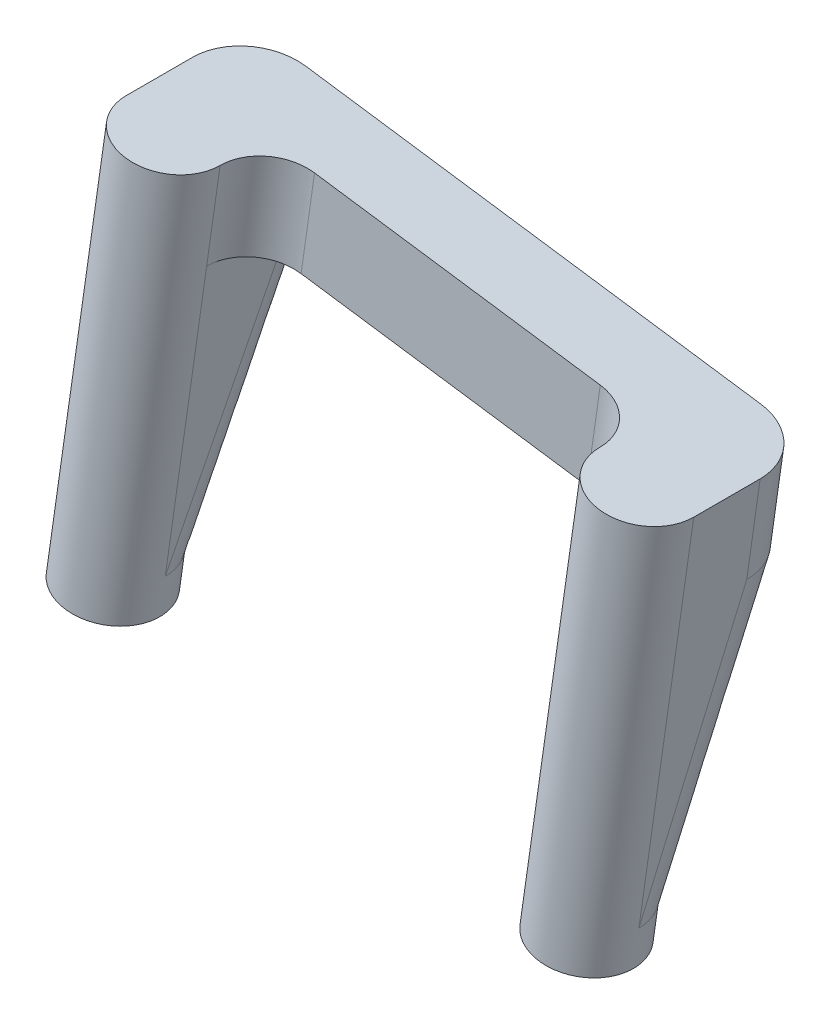
ISO-10303-21;
HEADER;
FILE_DESCRIPTION(('STEP AP214'),'2;1');
FILE_NAME('part.step','',(''),(''),'','','');
FILE_SCHEMA(('AUTOMOTIVE_DESIGN { 1 0 10303 214 1 1 1 1 }'));
ENDSEC;
DATA;
#1=APPLICATION_CONTEXT('core data for automotive mechanical design processes');
#2=APPLICATION_PROTOCOL_DEFINITION('international standard','automotive_design',2000,#1);
#3=PRODUCT_CONTEXT('',#1,'mechanical');
#4=PRODUCT('Part','Part','',(#3));
#5=PRODUCT_RELATED_PRODUCT_CATEGORY('part','',(#4));
#6=PRODUCT_DEFINITION_FORMATION('','',#4);
#7=PRODUCT_DEFINITION_CONTEXT('part definition',#1,'design');
#8=PRODUCT_DEFINITION('design','',#6,#7);
#9=PRODUCT_DEFINITION_SHAPE('','',#8);
#10=(LENGTH_UNIT() NAMED_UNIT(*) SI_UNIT(.MILLI.,.METRE.));
#11=(NAMED_UNIT(*) PLANE_ANGLE_UNIT() SI_UNIT($,.RADIAN.));
#12=(NAMED_UNIT(*) SI_UNIT($,.STERADIAN.) SOLID_ANGLE_UNIT());
#13=UNCERTAINTY_MEASURE_WITH_UNIT(LENGTH_MEASURE(1.E-05),#10,'distance_accuracy_value','');
#14=(GEOMETRIC_REPRESENTATION_CONTEXT(3) GLOBAL_UNCERTAINTY_ASSIGNED_CONTEXT((#13)) GLOBAL_UNIT_ASSIGNED_CONTEXT((#10,
#11,#12)) REPRESENTATION_CONTEXT('',''));
#15=CARTESIAN_POINT('',(0.,0.,0.));
#16=DIRECTION('',(0.,0.,1.));
#17=DIRECTION('',(1.,0.,0.));
#18=AXIS2_PLACEMENT_3D('',#15,#16,#17);
#19=CARTESIAN_POINT('',(98.8270928297793,157.961249583862,53.5258814494827));
#20=DIRECTION('',(0.141668597342475,0.989914141997686,0.));
#21=DIRECTION('',(-0.989914141997686,0.141668597342475,0.));
#22=AXIS2_PLACEMENT_3D('',#19,#20,#21);
#23=CYLINDRICAL_SURFACE('',#22,3.);
#24=CARTESIAN_POINT('',(98.8270928297793,157.961249583862,53.5258814494827));
#25=DIRECTION('',(-0.141668597342475,-0.989914141997686,0.));
#26=DIRECTION('',(0.989914141997687,-0.141668597342475,0.));
#27=AXIS2_PLACEMENT_3D('',#24,#25,#26);
#28=CIRCLE('',#27,2.99999999999999);
#29=CARTESIAN_POINT('',(100.681636853488,157.695842070824,51.1826465258096));
#30=VERTEX_POINT('',#29);
#31=CARTESIAN_POINT('',(101.146701782475,157.629285696521,51.6524360069134));
#32=VERTEX_POINT('',#31);
#33=EDGE_CURVE('E584',#30,#32,#28,.T.);
#34=ORIENTED_EDGE('',*,*,#33,.F.);
#35=CARTESIAN_POINT('',(100.09086644947,157.780388407661,50.8110445762304));
#36=VERTEX_POINT('',#35);
#37=EDGE_CURVE('E585',#36,#30,#28,.T.);
#38=ORIENTED_EDGE('',*,*,#37,.F.);
#39=CARTESIAN_POINT('',(98.8270928297793,157.961249583862,50.5258814494828));
#40=VERTEX_POINT('',#39);
#41=EDGE_CURVE('E573',#40,#36,#28,.T.);
#42=ORIENTED_EDGE('',*,*,#41,.F.);
#43=DIRECTION('',(0.141668597342475,0.989914141997686,0.));
#44=VECTOR('',#43,1.);
#45=CARTESIAN_POINT('',(98.8270928297793,157.961249583862,50.5258814494827));
#46=LINE('',#45,#44);
#47=CARTESIAN_POINT('',(99.5354358164917,162.91082029385,50.5258814494827));
#48=VERTEX_POINT('',#47);
#49=EDGE_CURVE('E355',#40,#48,#46,.T.);
#50=ORIENTED_EDGE('',*,*,#49,.T.);
#51=CARTESIAN_POINT('',(99.5354358164917,162.91082029385,53.5258814494827));
#52=DIRECTION('',(0.141668597342474,0.989914141997687,0.));
#53=DIRECTION('',(-0.989914141997687,0.141668597342474,0.));
#54=AXIS2_PLACEMENT_3D('',#51,#52,#53);
#55=CIRCLE('',#54,3.);
#56=CARTESIAN_POINT('',(102.505178242485,162.485814501823,53.5258814494827));
#57=VERTEX_POINT('',#56);
#58=EDGE_CURVE('E650',#48,#57,#55,.F.);
#59=ORIENTED_EDGE('',*,*,#58,.T.);
#60=DIRECTION('',(0.141668597342475,0.989914141997686,0.));
#61=VECTOR('',#60,1.);
#62=CARTESIAN_POINT('',(101.796835255772,157.536243791834,53.5258814494827));
#63=LINE('',#62,#61);
#64=CARTESIAN_POINT('',(101.796835255772,157.536243791834,53.5258814494827));
#65=VERTEX_POINT('',#64);
#66=EDGE_CURVE('E352',#65,#57,#63,.T.);
#67=ORIENTED_EDGE('',*,*,#66,.F.);
#68=CARTESIAN_POINT('',(101.514540347983,157.576643582005,52.2492353953649));
#69=VERTEX_POINT('',#68);
#70=EDGE_CURVE('E590',#69,#65,#28,.T.);
#71=ORIENTED_EDGE('',*,*,#70,.F.);
#72=EDGE_CURVE('E586',#32,#69,#28,.T.);
#73=ORIENTED_EDGE('',*,*,#72,.F.);
#74=EDGE_LOOP('',(#34,#38,#42,#50,#59,#67,#71,#73));
#75=FACE_BOUND('',#74,.T.);
#76=ADVANCED_FACE('F190',(#75),#23,.T.);
#77=CARTESIAN_POINT('',(74.8711705934353,161.38962963955,53.5258814494827));
#78=DIRECTION('',(0.141668597342475,0.989914141997686,0.));
#79=DIRECTION('',(-0.989914141997686,0.141668597342475,0.));
#80=AXIS2_PLACEMENT_3D('',#77,#78,#79);
#81=CYLINDRICAL_SURFACE('',#80,3.);
#82=CARTESIAN_POINT('',(74.8711705934353,161.38962963955,53.5258814494827));
#83=DIRECTION('',(-0.141668597342475,-0.989914141997686,0.));
#84=DIRECTION('',(0.989914141997687,-0.141668597342475,0.));
#85=AXIS2_PLACEMENT_3D('',#82,#83,#84);
#86=CIRCLE('',#85,3.);
#87=CARTESIAN_POINT('',(73.6074006100787,161.570490295348,50.8110525525518));
#88=VERTEX_POINT('',#87);
#89=CARTESIAN_POINT('',(74.8711705934353,161.38962963955,50.5258814494827));
#90=VERTEX_POINT('',#89);
#91=EDGE_CURVE('E438',#88,#90,#86,.T.);
#92=ORIENTED_EDGE('',*,*,#91,.F.);
#93=CARTESIAN_POINT('',(73.0166805743831,161.655029416934,51.1827148469126));
#94=CARTESIAN_POINT('',(73.0470771436798,161.651057670764,51.1582071911673));
#95=CARTESIAN_POINT('',(73.0779445237038,161.646974675022,51.1343013734666));
#96=CARTESIAN_POINT('',(73.1404708756815,161.638570880599,51.0878005567537));
#97=CARTESIAN_POINT('',(73.1721271218264,161.634250851714,51.0652017532638));
#98=CARTESIAN_POINT('',(73.23621940493,161.625340469877,51.0213047820807));
#99=CARTESIAN_POINT('',(73.2686541665748,161.620750543263,51.0000046659016));
#100=CARTESIAN_POINT('',(73.3343008034066,161.611306688164,50.9587001834623));
#101=CARTESIAN_POINT('',(73.3675126759895,161.606452760564,50.9386958128606));
#102=CARTESIAN_POINT('',(73.4347185953669,161.59650913484,50.899983714717));
#103=CARTESIAN_POINT('',(73.4687137714037,161.591419084018,50.8812780383608));
#104=CARTESIAN_POINT('',(73.5374992531925,161.581064236819,50.8451698254991));
#105=CARTESIAN_POINT('',(73.5722916857937,161.57579895043,50.8277714809408));
#106=CARTESIAN_POINT('',(73.6074091113198,161.570489077769,50.8110708152159));
#107=B_SPLINE_CURVE_WITH_KNOTS('',3,(#93,#94,#95,#96,#97,#98,#99,#100,#101,#102,#103,#104,#105,
#106),.UNSPECIFIED.,.F.,.F.,(4,2,2,2,2,2,4),(0.,0.117734479128843,0.235106949538339,
0.352298751936064,0.469490161651336,0.586862642552341,0.704596699130529),.UNSPECIFIED.);
#108=CARTESIAN_POINT('',(73.0166204555477,161.6550380276,51.1826388850392));
#109=VERTEX_POINT('',#108);
#110=EDGE_CURVE('E439',#109,#88,#107,.T.);
#111=ORIENTED_EDGE('',*,*,#110,.F.);
#112=CARTESIAN_POINT('',(72.5515692044727,161.72159244443,51.652442183354));
#113=VERTEX_POINT('',#112);
#114=EDGE_CURVE('E446',#113,#109,#86,.T.);
#115=ORIENTED_EDGE('',*,*,#114,.F.);
#116=CARTESIAN_POINT('',(72.1837151793978,161.774236771395,52.2492317218964));
#117=VERTEX_POINT('',#116);
#118=EDGE_CURVE('E462',#117,#113,#86,.T.);
#119=ORIENTED_EDGE('',*,*,#118,.F.);
#120=CARTESIAN_POINT('',(71.9014281674423,161.814635431577,53.5258814494827));
#121=VERTEX_POINT('',#120);
#122=EDGE_CURVE('E391',#121,#117,#86,.T.);
#123=ORIENTED_EDGE('',*,*,#122,.F.);
#124=DIRECTION('',(0.141668597342475,0.989914141997686,0.));
#125=VECTOR('',#124,1.);
#126=CARTESIAN_POINT('',(71.9014281674423,161.814635431577,53.5258814494827));
#127=LINE('',#126,#125);
#128=CARTESIAN_POINT('',(72.6097711541547,166.764206141566,53.5258814494827));
#129=VERTEX_POINT('',#128);
#130=EDGE_CURVE('E380',#121,#129,#127,.T.);
#131=ORIENTED_EDGE('',*,*,#130,.T.);
#132=CARTESIAN_POINT('',(75.5795135801477,166.339200349538,53.5258814494827));
#133=DIRECTION('',(0.141668597342474,0.989914141997687,0.));
#134=DIRECTION('',(-0.989914141997687,0.141668597342474,0.));
#135=AXIS2_PLACEMENT_3D('',#132,#133,#134);
#136=CIRCLE('',#135,3.);
#137=CARTESIAN_POINT('',(75.5795135801477,166.339200349538,50.5258814494827));
#138=VERTEX_POINT('',#137);
#139=EDGE_CURVE('E656',#129,#138,#136,.F.);
#140=ORIENTED_EDGE('',*,*,#139,.T.);
#141=DIRECTION('',(0.141668597342475,0.989914141997686,0.));
#142=VECTOR('',#141,1.);
#143=CARTESIAN_POINT('',(74.8711705934353,161.38962963955,50.5258814494827));
#144=LINE('',#143,#142);
#145=EDGE_CURVE('E442',#90,#138,#144,.T.);
#146=ORIENTED_EDGE('',*,*,#145,.F.);
#147=EDGE_LOOP('',(#92,#111,#115,#119,#123,#131,#140,#146));
#148=FACE_BOUND('',#147,.T.);
#149=ADVANCED_FACE('F398',(#148),#81,.T.);
#150=CARTESIAN_POINT('',(24.1359047436339,168.650455244318,-1.13689824128457E-13));
#151=DIRECTION('',(0.141668597342474,0.989914141997687,0.));
#152=DIRECTION('',(-0.989914141997687,0.141668597342474,0.));
#153=AXIS2_PLACEMENT_3D('',#150,#151,#152);
#154=PLANE('',#153);
#155=CARTESIAN_POINT('',(96.8472645457839,158.244586778547,52.5258814494827));
#156=CARTESIAN_POINT('',(96.8472448467732,158.244589597712,52.4695768784455));
#157=CARTESIAN_POINT('',(96.8495429879411,158.244260706122,52.4132637350063));
#158=CARTESIAN_POINT('',(96.8588200791974,158.242933042995,52.3010434435094));
#159=CARTESIAN_POINT('',(96.8657982033263,158.241934389661,52.2451362255706));
#160=CARTESIAN_POINT('',(96.8844750658468,158.239261506425,52.1341621611451));
#161=CARTESIAN_POINT('',(96.896171131682,158.237587658996,52.0790948571727));
#162=CARTESIAN_POINT('',(96.9241900762037,158.233577811676,51.9701754140498));
#163=CARTESIAN_POINT('',(96.94051306131,158.231241796555,51.9163233028796));
#164=CARTESIAN_POINT('',(96.977586248227,158.225936178454,51.810201374565));
#165=CARTESIAN_POINT('',(96.9983364037024,158.222966582106,51.7579315408668));
#166=CARTESIAN_POINT('',(97.0440262958585,158.216427810045,51.6552962187634));
#167=CARTESIAN_POINT('',(97.0689660564899,158.212858630905,51.6049307412469));
#168=CARTESIAN_POINT('',(97.122944127911,158.205133720894,51.5064992674636));
#169=CARTESIAN_POINT('',(97.1519814982116,158.200978124619,51.4584327469172));
#170=CARTESIAN_POINT('',(97.2139643963663,158.192107627807,51.3649656672834));
#171=CARTESIAN_POINT('',(97.2469100457429,158.187392709878,51.3195651911585));
#172=CARTESIAN_POINT('',(97.351662053527,158.172401440048,51.1873813541405));
#173=CARTESIAN_POINT('',(97.4291471059741,158.161312398858,51.1050466041796));
#174=CARTESIAN_POINT('',(97.5966097505536,158.13734648408,50.9549205003877));
#175=CARTESIAN_POINT('',(97.6865913243979,158.124469040661,50.88713379953));
#176=CARTESIAN_POINT('',(97.9701754310067,158.083884750663,50.7093418612083));
#177=CARTESIAN_POINT('',(98.1792776851407,158.053959707886,50.6226032393789));
#178=CARTESIAN_POINT('',(98.4662037991416,158.012897136511,50.5576614046544));
#179=CARTESIAN_POINT('',(98.5378822552514,158.002639088963,50.5456888147095));
#180=CARTESIAN_POINT('',(98.682028915595,157.98200997143,50.5297941934569));
#181=CARTESIAN_POINT('',(98.7544961201877,157.971639044506,50.5258629481201));
#182=CARTESIAN_POINT('',(98.8270928297793,157.961249583862,50.5258814494828));
#183=B_SPLINE_CURVE_WITH_KNOTS('',3,(#155,#156,#157,#158,#159,#160,#161,#162,#163,#164,#165,
#166,#167,#168,#169,#170,#171,#172,#173,#174,#175,#176,#177,#178,#179,#180,#181,#182),
.UNSPECIFIED.,.F.,.F.,(4,2,2,2,2,2,2,2,2,2,2,2,2,4),(0.,0.168877446174552,0.337725095389041,
0.506477232065389,0.675233250384617,0.843987502569643,1.01274271950168,1.181459266309,
1.35018106049599,1.68908461772352,2.02809640711591,2.69760684098695,2.91748695367373,
3.13711497926469),.UNSPECIFIED.);
#184=CARTESIAN_POINT('',(96.8472645457839,158.244586778547,52.5258814494827));
#185=VERTEX_POINT('',#184);
#186=EDGE_CURVE('E463',#185,#40,#183,.T.);
#187=ORIENTED_EDGE('',*,*,#186,.F.);
#188=DIRECTION('',(0.,0.,-1.));
#189=VECTOR('',#188,1.);
#190=CARTESIAN_POINT('',(96.8472645457839,158.244586778547,57.0258814494827));
#191=LINE('',#190,#189);
#192=CARTESIAN_POINT('',(96.8472645457839,158.244586778547,57.0258814494827));
#193=VERTEX_POINT('',#192);
#194=EDGE_CURVE('E524',#193,#185,#191,.T.);
#195=ORIENTED_EDGE('',*,*,#194,.F.);
#196=CARTESIAN_POINT('',(94.3724791907897,158.598758271903,57.0258814494827));
#197=DIRECTION('',(0.141668597342474,0.989914141997687,0.));
#198=DIRECTION('',(-0.989914141997687,0.141668597342474,0.));
#199=AXIS2_PLACEMENT_3D('',#196,#197,#198);
#200=CIRCLE('',#199,2.5);
#201=CARTESIAN_POINT('',(94.3724791907897,158.598758271903,54.5258814494827));
#202=VERTEX_POINT('',#201);
#203=EDGE_CURVE('E648',#193,#202,#200,.T.);
#204=ORIENTED_EDGE('',*,*,#203,.T.);
#205=DIRECTION('',(0.989914141997687,-0.141668597342474,0.));
#206=VECTOR('',#205,1.);
#207=CARTESIAN_POINT('',(24.1359047436339,168.650455244318,54.5258814494827));
#208=LINE('',#207,#206);
#209=CARTESIAN_POINT('',(79.3257842324249,160.752120951509,54.5258814494827));
#210=VERTEX_POINT('',#209);
#211=EDGE_CURVE('E645',#210,#202,#208,.T.);
#212=ORIENTED_EDGE('',*,*,#211,.F.);
#213=CARTESIAN_POINT('',(79.3257842324249,160.752120951509,57.0258814494827));
#214=DIRECTION('',(0.141668597342474,0.989914141997687,0.));
#215=DIRECTION('',(-0.989914141997687,0.141668597342474,0.));
#216=AXIS2_PLACEMENT_3D('',#213,#214,#215);
#217=CIRCLE('',#216,2.50000000000001);
#218=CARTESIAN_POINT('',(76.8509988774307,161.106292444865,57.0258814494828));
#219=VERTEX_POINT('',#218);
#220=EDGE_CURVE('E643',#210,#219,#217,.T.);
#221=ORIENTED_EDGE('',*,*,#220,.T.);
#222=DIRECTION('',(0.,0.,1.));
#223=VECTOR('',#222,1.);
#224=CARTESIAN_POINT('',(76.8509988774307,161.106292444865,57.0258814494828));
#225=LINE('',#224,#223);
#226=CARTESIAN_POINT('',(76.8509988774307,161.106292444865,52.5258814494827));
#227=VERTEX_POINT('',#226);
#228=EDGE_CURVE('E517',#227,#219,#225,.T.);
#229=ORIENTED_EDGE('',*,*,#228,.F.);
#230=CARTESIAN_POINT('',(74.8711705934353,161.38962963955,50.5258814494827));
#231=CARTESIAN_POINT('',(74.9269164241862,161.381651741957,50.5258615356743));
#232=CARTESIAN_POINT('',(74.9826707445061,161.373672629406,50.5281838599682));
#233=CARTESIAN_POINT('',(75.0937772710459,161.357771951657,50.5375585680152));
#234=CARTESIAN_POINT('',(75.1491295465954,161.349850376539,50.544610115685));
#235=CARTESIAN_POINT('',(75.2590018238548,161.334126334679,50.5634834784682));
#236=CARTESIAN_POINT('',(75.3135222783202,161.326323803143,50.575302594946));
#237=CARTESIAN_POINT('',(75.421359693352,161.310890974496,50.603616257291));
#238=CARTESIAN_POINT('',(75.4746766260692,161.303260681371,50.6201109112295));
#239=CARTESIAN_POINT('',(75.5797434407206,161.288224358898,50.6575738260444));
#240=CARTESIAN_POINT('',(75.6314933388251,161.280818327238,50.6785420407401));
#241=CARTESIAN_POINT('',(75.7331070789971,161.266276181177,50.7247120248034));
#242=CARTESIAN_POINT('',(75.7829709104378,161.259140068297,50.7499138180206));
#243=CARTESIAN_POINT('',(75.8804211239414,161.245193772884,50.8044589209834));
#244=CARTESIAN_POINT('',(75.9280080272153,161.238383515759,50.8338012767817));
#245=CARTESIAN_POINT('',(76.0205414985132,161.22514086518,50.8964350218626));
#246=CARTESIAN_POINT('',(76.0654879844044,161.21870848348,50.9297265338904));
#247=CARTESIAN_POINT('',(76.1963338674581,161.199982866849,51.0355660667786));
#248=CARTESIAN_POINT('',(76.2778294246182,161.18831987429,51.1138494385948));
#249=CARTESIAN_POINT('',(76.4264224241892,161.167054432237,51.2830343967947));
#250=CARTESIAN_POINT('',(76.493515259033,161.157452642141,51.3739400058807));
#251=CARTESIAN_POINT('',(76.669482925719,161.1322695566,51.6604330330839));
#252=CARTESIAN_POINT('',(76.7553243046023,161.119984624781,51.8716755901942));
#253=CARTESIAN_POINT('',(76.8195712562523,161.110790114735,52.1614964678972));
#254=CARTESIAN_POINT('',(76.8314111113913,161.10909568933,52.2338698749654));
#255=CARTESIAN_POINT('',(76.8471294551706,161.106846205641,52.3794131090318));
#256=CARTESIAN_POINT('',(76.851017064278,161.106289842109,52.4525819267928));
#257=CARTESIAN_POINT('',(76.8509988774307,161.106292444865,52.5258814494827));
#258=B_SPLINE_CURVE_WITH_KNOTS('',3,(#230,#231,#232,#233,#234,#235,#236,#237,#238,#239,#240,
#241,#242,#243,#244,#245,#246,#247,#248,#249,#250,#251,#252,#253,#254,#255,#256,#257),
.UNSPECIFIED.,.F.,.F.,(4,2,2,2,2,2,2,2,2,2,2,2,2,4),(0.,0.168905124837256,0.337780396669561,
0.50656021214237,0.675343929141257,0.844125903866178,1.01290882944429,1.18165293229897,
1.35040228133102,1.68930488151975,2.02831573881649,2.69782705538182,2.91759715820847,
3.1371150640582),.UNSPECIFIED.);
#259=EDGE_CURVE('E215',#90,#227,#258,.T.);
#260=ORIENTED_EDGE('',*,*,#259,.F.);
#261=DIRECTION('',(0.989914141997687,-0.141668597342474,0.));
#262=VECTOR('',#261,1.);
#263=CARTESIAN_POINT('',(24.1359047436339,168.650455244318,50.5258814494827));
#264=LINE('',#263,#262);
#265=EDGE_CURVE('E383',#90,#40,#264,.T.);
#266=ORIENTED_EDGE('',*,*,#265,.T.);
#267=EDGE_LOOP('',(#187,#195,#204,#212,#221,#229,#260,#266));
#268=FACE_BOUND('',#267,.T.);
#269=ADVANCED_FACE('F408',(#268),#154,.F.);
#270=CARTESIAN_POINT('',(73.0445287074172,152.155271003443,57.0258814494827));
#271=DIRECTION('',(-0.141668597342475,-0.989914141997686,0.));
#272=DIRECTION('',(0.989914141997687,-0.141668597342475,0.));
#273=AXIS2_PLACEMENT_3D('',#270,#271,#272);
#274=CYLINDRICAL_SURFACE('',#273,2.5);
#275=CARTESIAN_POINT('',(71.9111799286774,144.235957867461,57.0258814494827));
#276=DIRECTION('',(0.141668597342475,0.989914141997686,0.));
#277=DIRECTION('',(-0.989914141997686,0.141668597342475,0.));
#278=AXIS2_PLACEMENT_3D('',#275,#276,#277);
#279=CIRCLE('',#278,2.5);
#280=CARTESIAN_POINT('',(69.4363945736832,144.590129360817,57.0258814494827));
#281=VERTEX_POINT('',#280);
#282=EDGE_CURVE('E652',#281,#281,#279,.T.);
#283=ORIENTED_EDGE('',*,*,#282,.T.);
#284=EDGE_LOOP('',(#283));
#285=FACE_BOUND('',#284,.T.);
#286=DIRECTION('',(0.141668597342475,0.989914141997686,0.));
#287=VECTOR('',#286,1.);
#288=CARTESIAN_POINT('',(73.2241964053838,135.763886825981,57.0258814494828));
#289=LINE('',#288,#287);
#290=CARTESIAN_POINT('',(74.6693024783566,145.861614658101,57.0258814494827));
#291=VERTEX_POINT('',#290);
#292=EDGE_CURVE('E617',#291,#219,#289,.T.);
#293=ORIENTED_EDGE('',*,*,#292,.T.);
#294=DIRECTION('',(0.141668597342475,0.989914141997686,0.));
#295=VECTOR('',#294,1.);
#296=CARTESIAN_POINT('',(76.8509988774307,161.106292444865,57.0258814494827));
#297=LINE('',#296,#295);
#298=CARTESIAN_POINT('',(77.5593418641431,166.055863154853,57.0258814494827));
#299=VERTEX_POINT('',#298);
#300=EDGE_CURVE('E371',#219,#299,#297,.T.);
#301=ORIENTED_EDGE('',*,*,#300,.T.);
#302=CARTESIAN_POINT('',(75.0845565091488,166.410034648209,57.0258814494827));
#303=DIRECTION('',(0.141668597342475,0.989914141997686,0.));
#304=DIRECTION('',(-0.989914141997686,0.141668597342475,0.));
#305=AXIS2_PLACEMENT_3D('',#302,#303,#304);
#306=CIRCLE('',#305,2.50000000000001);
#307=CARTESIAN_POINT('',(72.6097711541547,166.764206141566,57.0258814494827));
#308=VERTEX_POINT('',#307);
#309=EDGE_CURVE('E471',#308,#299,#306,.T.);
#310=ORIENTED_EDGE('',*,*,#309,.F.);
#311=DIRECTION('',(0.141668597342475,0.989914141997686,0.));
#312=VECTOR('',#311,1.);
#313=CARTESIAN_POINT('',(71.9014281674423,161.814635431577,57.0258814494827));
#314=LINE('',#313,#312);
#315=CARTESIAN_POINT('',(69.7197317683682,146.569957644813,57.0258814494828));
#316=VERTEX_POINT('',#315);
#317=EDGE_CURVE('E374',#316,#308,#314,.T.);
#318=ORIENTED_EDGE('',*,*,#317,.F.);
#319=CARTESIAN_POINT('',(74.6693024783566,145.861614658101,57.0258814494827));
#320=CARTESIAN_POINT('',(74.6693024783566,145.861614658101,56.7359956326079));
#321=CARTESIAN_POINT('',(74.5691759608211,145.875943964749,56.1078168030919));
#322=CARTESIAN_POINT('',(73.9991415873838,145.957522726679,55.2028703544198));
#323=CARTESIAN_POINT('',(73.1033223000928,146.085725220733,54.6270281179539));
#324=CARTESIAN_POINT('',(72.4814791930513,146.174718434391,54.5258814494828));
#325=CARTESIAN_POINT('',(71.8335819063952,146.267440313924,54.5258814494827));
#326=CARTESIAN_POINT('',(71.179191775646,146.361091397392,54.6796605579632));
#327=CARTESIAN_POINT('',(70.4040326752117,146.472025970216,55.2171544375245));
#328=CARTESIAN_POINT('',(69.8719598825968,146.548171974214,56.0002113386715));
#329=CARTESIAN_POINT('',(69.7197317683682,146.569957644813,56.6612688011183));
#330=CARTESIAN_POINT('',(69.7197317683682,146.569957644813,57.0258814494828));
#331=B_SPLINE_CURVE_WITH_KNOTS('',3,(#319,#320,#321,#322,#323,#324,#325,#326,#327,#328,#329,
#330),.UNSPECIFIED.,.F.,.F.,(4,1,1,1,2,1,1,1,4),(0.,0.110728226371339,0.221456452742678,
0.332184679114017,0.442912905485355,0.582184679114017,0.721456452742678,0.860728226371339,1.),.UNSPECIFIED.);
#332=CARTESIAN_POINT('',(72.1945171233624,146.215786151457,54.5258814494828));
#333=VERTEX_POINT('',#332);
#334=EDGE_CURVE('E613',#316,#333,#331,.F.);
#335=ORIENTED_EDGE('',*,*,#334,.T.);
#336=CARTESIAN_POINT('',(72.1945171233624,146.215786151457,57.0258814494827));
#337=DIRECTION('',(-0.141668597342475,-0.989914141997686,0.));
#338=DIRECTION('',(0.989914141997686,-0.141668597342475,0.));
#339=AXIS2_PLACEMENT_3D('',#336,#337,#338);
#340=CIRCLE('',#339,2.49999999999996);
#341=EDGE_CURVE('E604',#333,#291,#340,.T.);
#342=ORIENTED_EDGE('',*,*,#341,.T.);
#343=EDGE_LOOP('',(#293,#301,#310,#318,#335,#342));
#344=FACE_BOUND('',#343,.T.);
#345=ADVANCED_FACE('F529',(#285,#344),#274,.T.);
#346=CARTESIAN_POINT('',(97.9903650857589,148.585222350412,57.0258814494827));
#347=DIRECTION('',(-0.141668597342475,-0.989914141997686,0.));
#348=DIRECTION('',(0.989914141997687,-0.141668597342475,0.));
#349=AXIS2_PLACEMENT_3D('',#346,#347,#348);
#350=CYLINDRICAL_SURFACE('',#349,2.50000000000001);
#351=CARTESIAN_POINT('',(96.8570163070191,140.665909214431,57.0258814494827));
#352=DIRECTION('',(0.141668597342475,0.989914141997686,0.));
#353=DIRECTION('',(-0.989914141997686,0.141668597342475,0.));
#354=AXIS2_PLACEMENT_3D('',#351,#352,#353);
#355=CIRCLE('',#354,2.50000000000001);
#356=CARTESIAN_POINT('',(94.3822309520249,141.020080707787,57.0258814494827));
#357=VERTEX_POINT('',#356);
#358=EDGE_CURVE('E13',#357,#357,#355,.T.);
#359=ORIENTED_EDGE('',*,*,#358,.T.);
#360=EDGE_LOOP('',(#359));
#361=FACE_BOUND('',#360,.T.);
#362=DIRECTION('',(0.141668597342475,0.989914141997686,0.));
#363=VECTOR('',#362,1.);
#364=CARTESIAN_POINT('',(96.8472645457839,158.244586778547,57.0258814494827));
#365=LINE('',#364,#363);
#366=CARTESIAN_POINT('',(97.5556075324963,163.194157488535,57.0258814494827));
#367=VERTEX_POINT('',#366);
#368=EDGE_CURVE('E364',#193,#367,#365,.T.);
#369=ORIENTED_EDGE('',*,*,#368,.F.);
#370=DIRECTION('',(0.141668597342475,0.989914141997686,0.));
#371=VECTOR('',#370,1.);
#372=CARTESIAN_POINT('',(93.220462073737,132.902181159663,57.0258814494828));
#373=LINE('',#372,#371);
#374=CARTESIAN_POINT('',(94.6655681467098,142.999908991783,57.0258814494827));
#375=VERTEX_POINT('',#374);
#376=EDGE_CURVE('E333',#375,#193,#373,.T.);
#377=ORIENTED_EDGE('',*,*,#376,.F.);
#378=CARTESIAN_POINT('',(99.6151388566983,142.29156600507,57.0258814494827));
#379=CARTESIAN_POINT('',(99.6151388566983,142.29156600507,56.6612688011183));
#380=CARTESIAN_POINT('',(99.4629107424697,142.313351675669,56.0002113386715));
#381=CARTESIAN_POINT('',(98.9308379498548,142.389497679667,55.2171544375246));
#382=CARTESIAN_POINT('',(98.1556788494204,142.500432252492,54.6796605579631));
#383=CARTESIAN_POINT('',(97.5012887186713,142.594083335959,54.5258814494827));
#384=CARTESIAN_POINT('',(96.8533914320151,142.686805215492,54.5258814494827));
#385=CARTESIAN_POINT('',(96.2315483249735,142.77579842915,54.6270281179538));
#386=CARTESIAN_POINT('',(95.3357290376826,142.904000923204,55.2028703544198));
#387=CARTESIAN_POINT('',(94.7656946642453,142.985579685134,56.1078168030919));
#388=CARTESIAN_POINT('',(94.6655681467098,142.999908991783,56.7359956326079));
#389=CARTESIAN_POINT('',(94.6655681467098,142.999908991783,57.0258814494827));
#390=B_SPLINE_CURVE_WITH_KNOTS('',3,(#378,#379,#380,#381,#382,#383,#384,#385,#386,#387,#388,
#389),.UNSPECIFIED.,.F.,.F.,(4,1,1,1,2,1,1,1,4),(0.,0.13927177362866,0.27854354725732,
0.41781532088598,0.55708709451464,0.66781532088598,0.77854354725732,0.88927177362866,1.),.UNSPECIFIED.);
#391=CARTESIAN_POINT('',(97.1403535017041,142.645737498426,54.5258814494827));
#392=VERTEX_POINT('',#391);
#393=EDGE_CURVE('E317',#375,#392,#390,.F.);
#394=ORIENTED_EDGE('',*,*,#393,.T.);
#395=CARTESIAN_POINT('',(97.1403535017041,142.645737498426,57.0258814494827));
#396=DIRECTION('',(-0.141668597342475,-0.989914141997686,0.));
#397=DIRECTION('',(0.989914141997686,-0.141668597342475,0.));
#398=AXIS2_PLACEMENT_3D('',#395,#396,#397);
#399=CIRCLE('',#398,2.5);
#400=CARTESIAN_POINT('',(99.6151388566983,142.29156600507,57.0258814494827));
#401=VERTEX_POINT('',#400);
#402=EDGE_CURVE('E312',#392,#401,#399,.T.);
#403=ORIENTED_EDGE('',*,*,#402,.T.);
#404=DIRECTION('',(0.141668597342475,0.989914141997686,0.));
#405=VECTOR('',#404,1.);
#406=CARTESIAN_POINT('',(101.796835255772,157.536243791834,57.0258814494827));
#407=LINE('',#406,#405);
#408=CARTESIAN_POINT('',(102.505178242485,162.485814501823,57.0258814494827));
#409=VERTEX_POINT('',#408);
#410=EDGE_CURVE('E356',#401,#409,#407,.T.);
#411=ORIENTED_EDGE('',*,*,#410,.T.);
#412=CARTESIAN_POINT('',(100.030392887491,162.839985995179,57.0258814494827));
#413=DIRECTION('',(0.141668597342475,0.989914141997686,0.));
#414=DIRECTION('',(-0.989914141997686,0.141668597342475,0.));
#415=AXIS2_PLACEMENT_3D('',#412,#413,#414);
#416=CIRCLE('',#415,2.50000000000001);
#417=EDGE_CURVE('E377',#367,#409,#416,.T.);
#418=ORIENTED_EDGE('',*,*,#417,.F.);
#419=EDGE_LOOP('',(#369,#377,#394,#403,#411,#418));
#420=FACE_BOUND('',#419,.T.);
#421=ADVANCED_FACE('F192',(#361,#420),#350,.T.);
#422=CARTESIAN_POINT('',(96.8570163070191,140.665909214431,57.0258814494827));
#423=DIRECTION('',(0.141668597342475,0.989914141997686,0.));
#424=DIRECTION('',(-0.989914141997686,0.141668597342475,0.));
#425=AXIS2_PLACEMENT_3D('',#422,#423,#424);
#426=PLANE('',#425);
#427=ORIENTED_EDGE('',*,*,#358,.F.);
#428=EDGE_LOOP('',(#427));
#429=FACE_BOUND('',#428,.T.);
#430=CARTESIAN_POINT('',(96.8570163070191,140.665909214431,57.0258814494827));
#431=DIRECTION('',(0.141668597342475,0.989914141997686,0.));
#432=DIRECTION('',(-0.989914141997686,0.141668597342475,0.));
#433=AXIS2_PLACEMENT_3D('',#430,#431,#432);
#434=CIRCLE('',#433,0.850000000000016);
#435=CARTESIAN_POINT('',(96.015589286321,140.786327522172,57.0258814494827));
#436=VERTEX_POINT('',#435);
#437=EDGE_CURVE('E207',#436,#436,#434,.T.);
#438=ORIENTED_EDGE('',*,*,#437,.T.);
#439=EDGE_LOOP('',(#438));
#440=FACE_BOUND('',#439,.T.);
#441=ADVANCED_FACE('F691',(#429,#440),#426,.F.);
#442=CARTESIAN_POINT('',(97.9903650857589,148.585222350412,57.0258814494827));
#443=DIRECTION('',(-0.141668597342475,-0.989914141997686,0.));
#444=DIRECTION('',(0.989914141997687,-0.141668597342475,0.));
#445=AXIS2_PLACEMENT_3D('',#442,#443,#444);
#446=CYLINDRICAL_SURFACE('',#445,0.850000000000016);
#447=CARTESIAN_POINT('',(97.9903650857589,148.585222350412,57.0258814494827));
#448=DIRECTION('',(0.141668597342475,0.989914141997686,0.));
#449=DIRECTION('',(-0.989914141997686,0.141668597342475,0.));
#450=AXIS2_PLACEMENT_3D('',#447,#448,#449);
#451=CIRCLE('',#450,0.850000000000016);
#452=CARTESIAN_POINT('',(97.1489380650608,148.705640658153,57.0258814494827));
#453=VERTEX_POINT('',#452);
#454=EDGE_CURVE('E680',#453,#453,#451,.T.);
#455=ORIENTED_EDGE('',*,*,#454,.T.);
#456=EDGE_LOOP('',(#455));
#457=FACE_BOUND('',#456,.T.);
#458=ORIENTED_EDGE('',*,*,#437,.F.);
#459=EDGE_LOOP('',(#458));
#460=FACE_BOUND('',#459,.T.);
#461=ADVANCED_FACE('F693',(#457,#460),#446,.F.);
#462=CARTESIAN_POINT('',(97.9903650857589,148.585222350412,57.0258814494827));
#463=DIRECTION('',(0.141668597342475,0.989914141997686,0.));
#464=DIRECTION('',(-0.989914141997686,0.141668597342475,0.));
#465=AXIS2_PLACEMENT_3D('',#462,#463,#464);
#466=PLANE('',#465);
#467=ORIENTED_EDGE('',*,*,#454,.F.);
#468=EDGE_LOOP('',(#467));
#469=FACE_BOUND('',#468,.T.);
#470=ADVANCED_FACE('F695',(#469),#466,.F.);
#471=CARTESIAN_POINT('',(137.277236847848,157.509515487253,135.33213711772));
#472=DIRECTION('',(0.141668597342475,0.989914141997686,0.));
#473=DIRECTION('',(-0.989914141997686,0.141668597342475,0.));
#474=AXIS2_PLACEMENT_3D('',#471,#472,#473);
#475=PLANE('',#474);
#476=DIRECTION('',(0.,0.,-1.));
#477=VECTOR('',#476,1.);
#478=CARTESIAN_POINT('',(72.6097711541547,166.764206141566,-1.1438533748176E-13));
#479=LINE('',#478,#477);
#480=EDGE_CURVE('E658',#308,#129,#479,.T.);
#481=ORIENTED_EDGE('',*,*,#480,.F.);
#482=ORIENTED_EDGE('',*,*,#309,.T.);
#483=CARTESIAN_POINT('',(80.0341272191373,165.701691661497,57.0258814494827));
#484=DIRECTION('',(0.141668597342474,0.989914141997687,0.));
#485=DIRECTION('',(-0.989914141997687,0.141668597342474,0.));
#486=AXIS2_PLACEMENT_3D('',#483,#484,#485);
#487=CIRCLE('',#486,2.50000000000001);
#488=CARTESIAN_POINT('',(80.0341272191373,165.701691661497,54.5258814494827));
#489=VERTEX_POINT('',#488);
#490=EDGE_CURVE('E661',#489,#299,#487,.T.);
#491=ORIENTED_EDGE('',*,*,#490,.F.);
#492=DIRECTION('',(0.989914141997687,-0.141668597342474,0.));
#493=VECTOR('',#492,1.);
#494=CARTESIAN_POINT('',(24.8442477303463,173.600025954306,54.5258814494827));
#495=LINE('',#494,#493);
#496=CARTESIAN_POINT('',(95.0808221775021,163.548328981891,54.5258814494827));
#497=VERTEX_POINT('',#496);
#498=EDGE_CURVE('E663',#489,#497,#495,.T.);
#499=ORIENTED_EDGE('',*,*,#498,.T.);
#500=CARTESIAN_POINT('',(95.0808221775021,163.548328981891,57.0258814494827));
#501=DIRECTION('',(0.141668597342474,0.989914141997687,0.));
#502=DIRECTION('',(-0.989914141997687,0.141668597342474,0.));
#503=AXIS2_PLACEMENT_3D('',#500,#501,#502);
#504=CIRCLE('',#503,2.5);
#505=EDGE_CURVE('E666',#367,#497,#504,.T.);
#506=ORIENTED_EDGE('',*,*,#505,.F.);
#507=ORIENTED_EDGE('',*,*,#417,.T.);
#508=DIRECTION('',(0.,0.,-1.));
#509=VECTOR('',#508,1.);
#510=CARTESIAN_POINT('',(102.505178242485,162.485814501823,-1.1438533748176E-13));
#511=LINE('',#510,#509);
#512=EDGE_CURVE('E669',#409,#57,#511,.T.);
#513=ORIENTED_EDGE('',*,*,#512,.T.);
#514=ORIENTED_EDGE('',*,*,#58,.F.);
#515=DIRECTION('',(0.989914141997687,-0.141668597342474,0.));
#516=VECTOR('',#515,1.);
#517=CARTESIAN_POINT('',(24.8442477303463,173.600025954306,50.5258814494827));
#518=LINE('',#517,#516);
#519=EDGE_CURVE('E362',#138,#48,#518,.T.);
#520=ORIENTED_EDGE('',*,*,#519,.F.);
#521=ORIENTED_EDGE('',*,*,#139,.F.);
#522=EDGE_LOOP('',(#481,#482,#491,#499,#506,#507,#513,#514,#520,#521));
#523=FACE_BOUND('',#522,.T.);
#524=ADVANCED_FACE('F411',(#523),#475,.T.);
#525=CARTESIAN_POINT('',(24.1359047436339,168.650455244318,50.5258814494827));
#526=DIRECTION('',(0.,0.,1.));
#527=DIRECTION('',(0.,-1.,0.));
#528=AXIS2_PLACEMENT_3D('',#525,#526,#527);
#529=PLANE('',#528);
#530=ORIENTED_EDGE('',*,*,#519,.T.);
#531=ORIENTED_EDGE('',*,*,#49,.F.);
#532=ORIENTED_EDGE('',*,*,#265,.F.);
#533=ORIENTED_EDGE('',*,*,#145,.T.);
#534=EDGE_LOOP('',(#530,#531,#532,#533));
#535=FACE_BOUND('',#534,.T.);
#536=ADVANCED_FACE('F533',(#535),#529,.F.);
#537=CARTESIAN_POINT('',(101.796835255772,157.536243791834,-1.13689824128457E-13));
#538=DIRECTION('',(0.989914141997686,-0.141668597342475,0.));
#539=DIRECTION('',(0.141668597342475,0.989914141997686,0.));
#540=AXIS2_PLACEMENT_3D('',#537,#538,#539);
#541=PLANE('',#540);
#542=DIRECTION('',(0.138145703902534,0.965297804274557,-0.221621103588969));
#543=VECTOR('',#542,1.);
#544=CARTESIAN_POINT('',(100.705987056235,149.913904898452,55.2758814494827));
#545=LINE('',#544,#543);
#546=EDGE_CURVE('E321',#401,#65,#545,.T.);
#547=ORIENTED_EDGE('',*,*,#546,.T.);
#548=ORIENTED_EDGE('',*,*,#66,.T.);
#549=ORIENTED_EDGE('',*,*,#512,.F.);
#550=ORIENTED_EDGE('',*,*,#410,.F.);
#551=EDGE_LOOP('',(#547,#548,#549,#550));
#552=FACE_BOUND('',#551,.T.);
#553=ADVANCED_FACE('F537',(#552),#541,.T.);
#554=CARTESIAN_POINT('',(94.3724791907897,158.598758271903,57.0258814494827));
#555=DIRECTION('',(0.141668597342475,0.989914141997686,0.));
#556=DIRECTION('',(-0.989914141997686,0.141668597342475,0.));
#557=AXIS2_PLACEMENT_3D('',#554,#555,#556);
#558=CYLINDRICAL_SURFACE('',#557,2.5);
#559=ORIENTED_EDGE('',*,*,#505,.T.);
#560=DIRECTION('',(0.141668597342475,0.989914141997686,0.));
#561=VECTOR('',#560,1.);
#562=CARTESIAN_POINT('',(94.3724791907897,158.598758271903,54.5258814494827));
#563=LINE('',#562,#561);
#564=EDGE_CURVE('E367',#202,#497,#563,.T.);
#565=ORIENTED_EDGE('',*,*,#564,.F.);
#566=ORIENTED_EDGE('',*,*,#203,.F.);
#567=ORIENTED_EDGE('',*,*,#368,.T.);
#568=EDGE_LOOP('',(#559,#565,#566,#567));
#569=FACE_BOUND('',#568,.T.);
#570=ADVANCED_FACE('F737',(#569),#558,.F.);
#571=CARTESIAN_POINT('',(24.1359047436339,168.650455244318,54.5258814494827));
#572=DIRECTION('',(0.,0.,1.));
#573=DIRECTION('',(0.,-1.,0.));
#574=AXIS2_PLACEMENT_3D('',#571,#572,#573);
#575=PLANE('',#574);
#576=ORIENTED_EDGE('',*,*,#498,.F.);
#577=DIRECTION('',(0.141668597342475,0.989914141997686,0.));
#578=VECTOR('',#577,1.);
#579=CARTESIAN_POINT('',(79.3257842324249,160.752120951509,54.5258814494827));
#580=LINE('',#579,#578);
#581=EDGE_CURVE('E369',#210,#489,#580,.T.);
#582=ORIENTED_EDGE('',*,*,#581,.F.);
#583=ORIENTED_EDGE('',*,*,#211,.T.);
#584=ORIENTED_EDGE('',*,*,#564,.T.);
#585=EDGE_LOOP('',(#576,#582,#583,#584));
#586=FACE_BOUND('',#585,.T.);
#587=ADVANCED_FACE('F733',(#586),#575,.T.);
#588=CARTESIAN_POINT('',(79.3257842324249,160.752120951509,57.0258814494827));
#589=DIRECTION('',(0.141668597342475,0.989914141997686,0.));
#590=DIRECTION('',(-0.989914141997686,0.141668597342475,0.));
#591=AXIS2_PLACEMENT_3D('',#588,#589,#590);
#592=CYLINDRICAL_SURFACE('',#591,2.50000000000001);
#593=ORIENTED_EDGE('',*,*,#490,.T.);
#594=ORIENTED_EDGE('',*,*,#300,.F.);
#595=ORIENTED_EDGE('',*,*,#220,.F.);
#596=ORIENTED_EDGE('',*,*,#581,.T.);
#597=EDGE_LOOP('',(#593,#594,#595,#596));
#598=FACE_BOUND('',#597,.T.);
#599=ADVANCED_FACE('F731',(#598),#592,.F.);
#600=CARTESIAN_POINT('',(71.9014281674423,161.814635431577,-1.13689824128457E-13));
#601=DIRECTION('',(0.989914141997686,-0.141668597342475,0.));
#602=DIRECTION('',(0.141668597342475,0.989914141997686,0.));
#603=AXIS2_PLACEMENT_3D('',#600,#601,#602);
#604=PLANE('',#603);
#605=ORIENTED_EDGE('',*,*,#130,.F.);
#606=DIRECTION('',(0.138145703902537,0.965297804274556,-0.22162110358897));
#607=VECTOR('',#606,1.);
#608=CARTESIAN_POINT('',(70.8105799679052,154.192296538195,55.2758814494828));
#609=LINE('',#608,#607);
#610=EDGE_CURVE('E448',#316,#121,#609,.T.);
#611=ORIENTED_EDGE('',*,*,#610,.F.);
#612=ORIENTED_EDGE('',*,*,#317,.T.);
#613=ORIENTED_EDGE('',*,*,#480,.T.);
#614=EDGE_LOOP('',(#605,#611,#612,#613));
#615=FACE_BOUND('',#614,.T.);
#616=ADVANCED_FACE('F409',(#615),#604,.F.);
#617=CARTESIAN_POINT('',(71.9111799286774,144.235957867461,57.0258814494827));
#618=DIRECTION('',(0.141668597342475,0.989914141997686,0.));
#619=DIRECTION('',(-0.989914141997686,0.141668597342475,0.));
#620=AXIS2_PLACEMENT_3D('',#617,#618,#619);
#621=PLANE('',#620);
#622=ORIENTED_EDGE('',*,*,#282,.F.);
#623=EDGE_LOOP('',(#622));
#624=FACE_BOUND('',#623,.T.);
#625=CARTESIAN_POINT('',(71.9111799286774,144.235957867461,57.0258814494827));
#626=DIRECTION('',(0.141668597342475,0.989914141997686,0.));
#627=DIRECTION('',(-0.989914141997686,0.141668597342475,0.));
#628=AXIS2_PLACEMENT_3D('',#625,#626,#627);
#629=CIRCLE('',#628,0.850000000000003);
#630=CARTESIAN_POINT('',(71.0697529079794,144.356376175202,57.0258814494827));
#631=VERTEX_POINT('',#630);
#632=EDGE_CURVE('E719',#631,#631,#629,.T.);
#633=ORIENTED_EDGE('',*,*,#632,.T.);
#634=EDGE_LOOP('',(#633));
#635=FACE_BOUND('',#634,.T.);
#636=ADVANCED_FACE('F793',(#624,#635),#621,.F.);
#637=CARTESIAN_POINT('',(73.0445287074172,152.155271003443,57.0258814494827));
#638=DIRECTION('',(-0.141668597342475,-0.989914141997686,0.));
#639=DIRECTION('',(0.989914141997687,-0.141668597342475,0.));
#640=AXIS2_PLACEMENT_3D('',#637,#638,#639);
#641=CYLINDRICAL_SURFACE('',#640,0.850000000000003);
#642=CARTESIAN_POINT('',(73.0445287074172,152.155271003443,57.0258814494827));
#643=DIRECTION('',(0.141668597342475,0.989914141997686,0.));
#644=DIRECTION('',(-0.989914141997686,0.141668597342475,0.));
#645=AXIS2_PLACEMENT_3D('',#642,#643,#644);
#646=CIRCLE('',#645,0.850000000000003);
#647=CARTESIAN_POINT('',(72.2031016867192,152.275689311184,57.0258814494827));
#648=VERTEX_POINT('',#647);
#649=EDGE_CURVE('E721',#648,#648,#646,.T.);
#650=ORIENTED_EDGE('',*,*,#649,.T.);
#651=EDGE_LOOP('',(#650));
#652=FACE_BOUND('',#651,.T.);
#653=ORIENTED_EDGE('',*,*,#632,.F.);
#654=EDGE_LOOP('',(#653));
#655=FACE_BOUND('',#654,.T.);
#656=ADVANCED_FACE('F788',(#652,#655),#641,.F.);
#657=CARTESIAN_POINT('',(73.0445287074172,152.155271003443,57.0258814494827));
#658=DIRECTION('',(0.141668597342475,0.989914141997686,0.));
#659=DIRECTION('',(-0.989914141997686,0.141668597342475,0.));
#660=AXIS2_PLACEMENT_3D('',#657,#658,#659);
#661=PLANE('',#660);
#662=ORIENTED_EDGE('',*,*,#649,.F.);
#663=EDGE_LOOP('',(#662));
#664=FACE_BOUND('',#663,.T.);
#665=ADVANCED_FACE('F784',(#664),#661,.F.);
#666=CARTESIAN_POINT('',(73.2241964053838,135.763886825981,57.0258814494828));
#667=DIRECTION('',(-0.989914141997686,0.141668597342475,0.));
#668=DIRECTION('',(-0.141668597342475,-0.989914141997687,0.));
#669=AXIS2_PLACEMENT_3D('',#666,#667,#668);
#670=PLANE('',#669);
#671=ORIENTED_EDGE('',*,*,#292,.F.);
#672=DIRECTION('',(0.135982057333325,0.95017925028781,-0.280478648752256));
#673=VECTOR('',#672,1.);
#674=CARTESIAN_POINT('',(75.7601506778936,153.483953551483,54.7758814494827));
#675=LINE('',#674,#673);
#676=EDGE_CURVE('E444',#291,#227,#675,.T.);
#677=ORIENTED_EDGE('',*,*,#676,.T.);
#678=ORIENTED_EDGE('',*,*,#228,.T.);
#679=EDGE_LOOP('',(#671,#677,#678));
#680=FACE_BOUND('',#679,.T.);
#681=ADVANCED_FACE('F637',(#680),#670,.F.);
#682=CARTESIAN_POINT('',(93.220462073737,132.902181159663,57.0258814494828));
#683=DIRECTION('',(0.989914141997686,-0.141668597342475,0.));
#684=DIRECTION('',(0.141668597342475,0.989914141997686,0.));
#685=AXIS2_PLACEMENT_3D('',#682,#683,#684);
#686=PLANE('',#685);
#687=ORIENTED_EDGE('',*,*,#194,.T.);
#688=DIRECTION('',(0.135982057333326,0.95017925028781,-0.280478648752254));
#689=VECTOR('',#688,1.);
#690=CARTESIAN_POINT('',(95.7564163462469,150.622247885165,54.7758814494827));
#691=LINE('',#690,#689);
#692=EDGE_CURVE('E326',#375,#185,#691,.T.);
#693=ORIENTED_EDGE('',*,*,#692,.F.);
#694=ORIENTED_EDGE('',*,*,#376,.T.);
#695=EDGE_LOOP('',(#687,#693,#694));
#696=FACE_BOUND('',#695,.T.);
#697=ADVANCED_FACE('F483',(#696),#686,.F.);
#698=CARTESIAN_POINT('',(69.7197317683682,146.569957644813,57.0258814494828));
#699=CARTESIAN_POINT('',(71.9014281674423,161.814635431577,53.5258814494827));
#700=CARTESIAN_POINT('',(71.923245131433,161.967082209445,53.4908814494827));
#701=CARTESIAN_POINT('',(69.7197317683682,146.569957644813,56.6612688011183));
#702=CARTESIAN_POINT('',(71.9014281674423,161.814635431577,53.1612688011183));
#703=CARTESIAN_POINT('',(71.923245131433,161.967082209445,53.1262688011183));
#704=CARTESIAN_POINT('',(69.8719598825968,146.548171974214,56.0002113386715));
#705=CARTESIAN_POINT('',(72.0353592852237,161.79546828082,52.3924965319291));
#706=CARTESIAN_POINT('',(72.05699327925,161.947941243886,52.3564193838617));
#707=CARTESIAN_POINT('',(70.4040326752117,146.472025970216,55.2171544375245));
#708=CARTESIAN_POINT('',(72.7102647084133,161.698881212724,51.3429589177758));
#709=CARTESIAN_POINT('',(72.7333270287453,161.851149765149,51.3042169625783));
#710=CARTESIAN_POINT('',(71.179191775646,146.361091397392,54.6796605579632));
#711=CARTESIAN_POINT('',(73.7492168352219,161.550194691069,50.661177140391));
#712=CARTESIAN_POINT('',(73.7749170858177,161.702085724006,50.6209923062153));
#713=CARTESIAN_POINT('',(71.8335819063952,146.267440313924,54.5258814494827));
#714=CARTESIAN_POINT('',(74.5102353764681,161.441283802017,50.5258814494827));
#715=CARTESIAN_POINT('',(74.5370019111689,161.593022236898,50.4858814494827));
#716=CARTESIAN_POINT('',(72.4814791930513,146.174718434391,54.5258814494828));
#717=CARTESIAN_POINT('',(75.1581326631243,161.348561922484,50.5258814494827));
#718=CARTESIAN_POINT('',(75.184899197825,161.500300357365,50.4858814494827));
#719=CARTESIAN_POINT('',(73.1033223000928,146.085725220733,54.6270281179539));
#720=CARTESIAN_POINT('',(75.6815843675615,161.273649699698,50.6479541321494));
#721=CARTESIAN_POINT('',(75.7073669882361,161.425528944487,50.6081633922913));
#722=CARTESIAN_POINT('',(73.9991415873838,145.957522726679,55.2028703544198));
#723=CARTESIAN_POINT('',(76.3038079991557,161.184602028409,51.0786474471186));
#724=CARTESIAN_POINT('',(76.3268546632734,161.336872821426,51.0374052180456));
#725=CARTESIAN_POINT('',(74.5691759608211,145.875943964749,56.1078168030919));
#726=CARTESIAN_POINT('',(76.7301574025073,161.123586310592,51.7072106782067));
#727=CARTESIAN_POINT('',(76.7517672169242,161.27606273405,51.6632046169578));
#728=CARTESIAN_POINT('',(74.6693024783566,145.861614658101,56.7359956326079));
#729=CARTESIAN_POINT('',(76.8509988774307,161.106292444865,52.2359956326079));
#730=CARTESIAN_POINT('',(76.8728158414214,161.258739222732,52.1909956326079));
#731=CARTESIAN_POINT('',(74.6693024783566,145.861614658101,57.0258814494827));
#732=CARTESIAN_POINT('',(76.8509988774307,161.106292444865,52.5258814494827));
#733=CARTESIAN_POINT('',(76.8728158414214,161.258739222732,52.4808814494827));
#734=B_SPLINE_SURFACE_WITH_KNOTS('',3,1,((#698,#699,#700),(#701,#702,#703),(#704,#705,#706),
(#707,#708,#709),(#710,#711,#712),(#713,#714,#715),(#716,#717,#718),(#719,#720,#721),(#722,#723,
#724),(#725,#726,#727),(#728,#729,#730),(#731,#732,#733)),.UNSPECIFIED.,.F.,.F.,.F.,(4,1,1,1,2,
1,1,1,4),(2,1,2),(0.,0.139271773628661,0.278543547257322,0.417815320885983,0.557087094514645,
0.667815320885983,0.778543547257322,0.889271773628661,1.),(0.,1.,1.01),.UNSPECIFIED.);
#735=ORIENTED_EDGE('',*,*,#110,.T.);
#736=ORIENTED_EDGE('',*,*,#91,.T.);
#737=ORIENTED_EDGE('',*,*,#259,.T.);
#738=ORIENTED_EDGE('',*,*,#676,.F.);
#739=ORIENTED_EDGE('',*,*,#341,.F.);
#740=ORIENTED_EDGE('',*,*,#334,.F.);
#741=ORIENTED_EDGE('',*,*,#610,.T.);
#742=ORIENTED_EDGE('',*,*,#122,.T.);
#743=ORIENTED_EDGE('',*,*,#118,.T.);
#744=ORIENTED_EDGE('',*,*,#114,.T.);
#745=EDGE_LOOP('',(#735,#736,#737,#738,#739,#740,#741,#742,#743,#744));
#746=FACE_BOUND('',#745,.T.);
#747=ADVANCED_FACE('F465',(#746),#734,.F.);
#748=CARTESIAN_POINT('',(94.6655681467098,142.999908991783,57.0258814494827));
#749=CARTESIAN_POINT('',(96.8472645457839,158.244586778547,52.5258814494827));
#750=CARTESIAN_POINT('',(94.6655681467098,142.999908991783,56.7359956326079));
#751=CARTESIAN_POINT('',(96.8472645457839,158.244586778547,52.2359956326079));
#752=CARTESIAN_POINT('',(94.7656946642453,142.985579685134,56.1078168030919));
#753=CARTESIAN_POINT('',(96.9681060207073,158.22729291282,51.7072106782068));
#754=CARTESIAN_POINT('',(95.3357290376826,142.904000923204,55.2028703544198));
#755=CARTESIAN_POINT('',(97.3944554240591,158.166277195003,51.0786474471185));
#756=CARTESIAN_POINT('',(96.2315483249735,142.77579842915,54.6270281179538));
#757=CARTESIAN_POINT('',(98.016679055653,158.077229523714,50.6479541321495));
#758=CARTESIAN_POINT('',(96.8533914320151,142.686805215492,54.5258814494827));
#759=CARTESIAN_POINT('',(98.5401307600903,158.002317300928,50.5258814494828));
#760=CARTESIAN_POINT('',(97.5012887186713,142.594083335959,54.5258814494827));
#761=CARTESIAN_POINT('',(99.1880280467465,157.909595421395,50.5258814494828));
#762=CARTESIAN_POINT('',(98.1556788494204,142.500432252492,54.6796605579631));
#763=CARTESIAN_POINT('',(99.9490465879923,157.800684532343,50.661177140391));
#764=CARTESIAN_POINT('',(98.9308379498548,142.389497679667,55.2171544375246));
#765=CARTESIAN_POINT('',(100.987998714802,157.651998010687,51.3429589177759));
#766=CARTESIAN_POINT('',(99.4629107424697,142.313351675669,56.0002113386715));
#767=CARTESIAN_POINT('',(101.662904137991,157.555410942592,52.392496531929));
#768=CARTESIAN_POINT('',(99.6151388566983,142.29156600507,56.6612688011183));
#769=CARTESIAN_POINT('',(101.796835255772,157.536243791834,53.1612688011183));
#770=CARTESIAN_POINT('',(99.6151388566983,142.29156600507,57.0258814494827));
#771=CARTESIAN_POINT('',(101.796835255772,157.536243791834,53.5258814494827));
#772=B_SPLINE_SURFACE_WITH_KNOTS('',3,1,((#748,#749),(#750,#751),(#752,#753),(#754,#755),(#756,
#757),(#758,#759),(#760,#761),(#762,#763),(#764,#765),(#766,#767),(#768,#769),(#770,#771)),
.UNSPECIFIED.,.F.,.F.,.F.,(4,1,1,1,2,1,1,1,4),(2,2),(0.,0.11072822637134,0.22145645274268,
0.33218467911402,0.44291290548536,0.58218467911402,0.72145645274268,0.86072822637134,1.),(0.,
1.),.UNSPECIFIED.);
#773=ORIENTED_EDGE('',*,*,#72,.T.);
#774=ORIENTED_EDGE('',*,*,#70,.T.);
#775=ORIENTED_EDGE('',*,*,#546,.F.);
#776=ORIENTED_EDGE('',*,*,#402,.F.);
#777=ORIENTED_EDGE('',*,*,#393,.F.);
#778=ORIENTED_EDGE('',*,*,#692,.T.);
#779=ORIENTED_EDGE('',*,*,#186,.T.);
#780=ORIENTED_EDGE('',*,*,#41,.T.);
#781=ORIENTED_EDGE('',*,*,#37,.T.);
#782=ORIENTED_EDGE('',*,*,#33,.T.);
#783=EDGE_LOOP('',(#773,#774,#775,#776,#777,#778,#779,#780,#781,#782));
#784=FACE_BOUND('',#783,.T.);
#785=ADVANCED_FACE('F315',(#784),#772,.F.);
#786=CLOSED_SHELL('',(#76,#149,#269,#345,#421,#441,#461,#470,#524,#536,#553,#570,#587,#599,#616,
#636,#656,#665,#681,#697,#747,#785));
#787=MANIFOLD_SOLID_BREP('B2',#786);
#788=ADVANCED_BREP_SHAPE_REPRESENTATION('',(#18,#787),#14);
#789=SHAPE_DEFINITION_REPRESENTATION(#9,#788);
ENDSEC;
END-ISO-10303-21;
